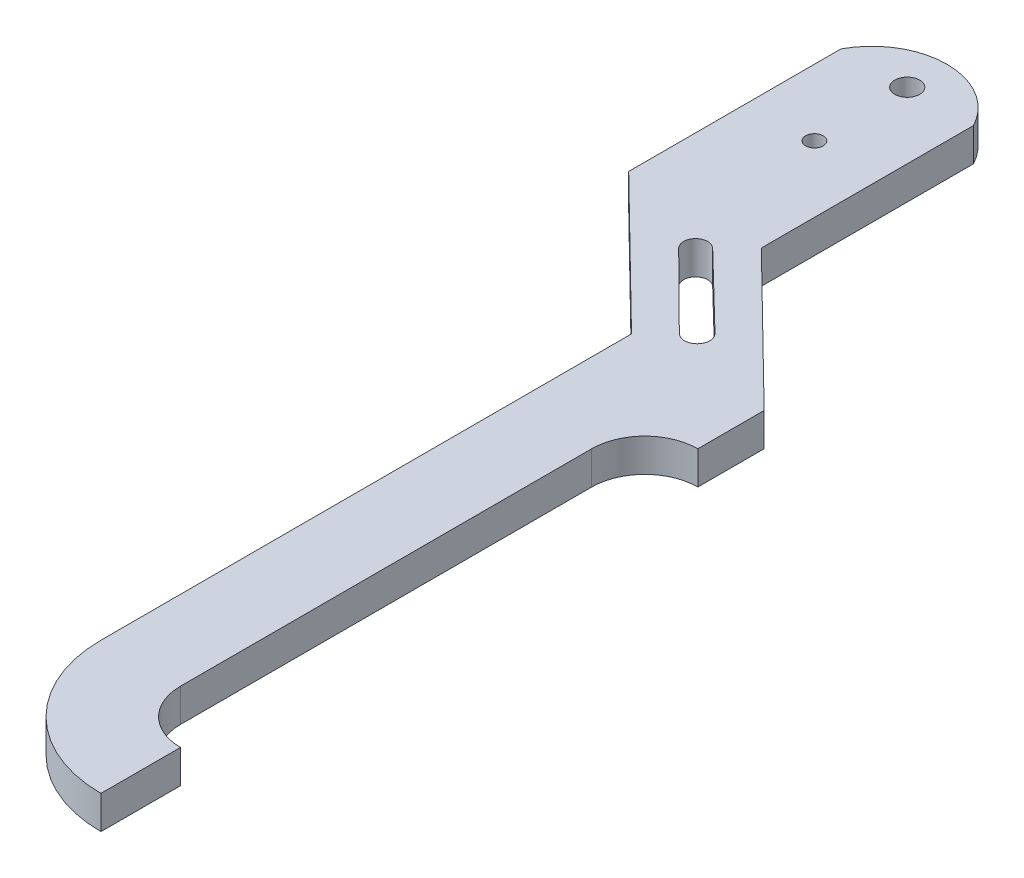
ISO-10303-21;
HEADER;
FILE_DESCRIPTION(('STEP AP214'),'2;1');
FILE_NAME('part.step','',(''),(''),'','','');
FILE_SCHEMA(('AUTOMOTIVE_DESIGN { 1 0 10303 214 1 1 1 1 }'));
ENDSEC;
DATA;
#1=APPLICATION_CONTEXT('core data for automotive mechanical design processes');
#2=APPLICATION_PROTOCOL_DEFINITION('international standard','automotive_design',2000,#1);
#3=PRODUCT_CONTEXT('',#1,'mechanical');
#4=PRODUCT('Part','Part','',(#3));
#5=PRODUCT_RELATED_PRODUCT_CATEGORY('part','',(#4));
#6=PRODUCT_DEFINITION_FORMATION('','',#4);
#7=PRODUCT_DEFINITION_CONTEXT('part definition',#1,'design');
#8=PRODUCT_DEFINITION('design','',#6,#7);
#9=PRODUCT_DEFINITION_SHAPE('','',#8);
#10=(LENGTH_UNIT() NAMED_UNIT(*) SI_UNIT(.MILLI.,.METRE.));
#11=(NAMED_UNIT(*) PLANE_ANGLE_UNIT() SI_UNIT($,.RADIAN.));
#12=(NAMED_UNIT(*) SI_UNIT($,.STERADIAN.) SOLID_ANGLE_UNIT());
#13=UNCERTAINTY_MEASURE_WITH_UNIT(LENGTH_MEASURE(1.E-05),#10,'distance_accuracy_value','');
#14=(GEOMETRIC_REPRESENTATION_CONTEXT(3) GLOBAL_UNCERTAINTY_ASSIGNED_CONTEXT((#13)) GLOBAL_UNIT_ASSIGNED_CONTEXT((#10,
#11,#12)) REPRESENTATION_CONTEXT('',''));
#15=CARTESIAN_POINT('',(0.,0.,0.));
#16=DIRECTION('',(0.,0.,1.));
#17=DIRECTION('',(1.,0.,0.));
#18=AXIS2_PLACEMENT_3D('',#15,#16,#17);
#19=CARTESIAN_POINT('',(13.2774006536528,3.175,8.37420016308551));
#20=DIRECTION('',(0.,1.,0.));
#21=DIRECTION('',(0.,0.,1.));
#22=AXIS2_PLACEMENT_3D('',#19,#20,#21);
#23=PLANE('',#22);
#24=DIRECTION('',(-0.718147190101119,0.,-0.695891236724437));
#25=VECTOR('',#24,1.);
#26=CARTESIAN_POINT('',(-2.63294068961359,3.175,-14.0382908603592));
#27=LINE('',#26,#25);
#28=CARTESIAN_POINT('',(4.52958585374168,3.175,-7.09773671904836));
#29=VERTEX_POINT('',#28);
#30=CARTESIAN_POINT('',(-2.63294068961359,3.175,-14.0382908603592));
#31=VERTEX_POINT('',#30);
#32=EDGE_CURVE('E154',#29,#31,#27,.T.);
#33=ORIENTED_EDGE('',*,*,#32,.F.);
#34=CARTESIAN_POINT('',(3.68641881720039,3.175,-6.23258353892776));
#35=DIRECTION('',(0.,1.,0.));
#36=DIRECTION('',(0.,0.,1.));
#37=AXIS2_PLACEMENT_3D('',#34,#35,#36);
#38=CIRCLE('',#37,1.20806484783831);
#39=CARTESIAN_POINT('',(2.84325178065911,3.175,-5.36743035880716));
#40=VERTEX_POINT('',#39);
#41=EDGE_CURVE('E146',#40,#29,#38,.T.);
#42=ORIENTED_EDGE('',*,*,#41,.F.);
#43=DIRECTION('',(0.710114988358507,0.,0.704085721562792));
#44=VECTOR('',#43,1.);
#45=CARTESIAN_POINT('',(2.84325178065911,3.175,-5.36743035880716));
#46=LINE('',#45,#44);
#47=CARTESIAN_POINT('',(-4.24408647952415,3.175,-12.394593219312));
#48=VERTEX_POINT('',#47);
#49=EDGE_CURVE('E169',#48,#40,#46,.T.);
#50=ORIENTED_EDGE('',*,*,#49,.F.);
#51=CARTESIAN_POINT('',(-3.43851358456887,3.175,-13.2164420398356));
#52=DIRECTION('',(0.,1.,0.));
#53=DIRECTION('',(0.,0.,-1.));
#54=AXIS2_PLACEMENT_3D('',#51,#52,#53);
#55=CIRCLE('',#54,1.15081847955389);
#56=EDGE_CURVE('E167',#31,#48,#55,.T.);
#57=ORIENTED_EDGE('',*,*,#56,.F.);
#58=EDGE_LOOP('',(#33,#42,#50,#57));
#59=FACE_BOUND('',#58,.T.);
#60=CARTESIAN_POINT('',(-6.67702050272131,3.175,-27.8207998369145));
#61=DIRECTION('',(0.,1.,0.));
#62=DIRECTION('',(0.,0.,-1.));
#63=AXIS2_PLACEMENT_3D('',#60,#61,#62);
#64=CIRCLE('',#63,0.840105000000002);
#65=CARTESIAN_POINT('',(-6.67702050272131,3.175,-28.6609048369145));
#66=VERTEX_POINT('',#65);
#67=EDGE_CURVE('E185',#66,#66,#64,.T.);
#68=ORIENTED_EDGE('',*,*,#67,.F.);
#69=EDGE_LOOP('',(#68));
#70=FACE_BOUND('',#69,.T.);
#71=CARTESIAN_POINT('',(13.2774006536528,3.175,8.37420016308551));
#72=DIRECTION('',(0.,-1.,0.));
#73=DIRECTION('',(0.,0.,1.));
#74=AXIS2_PLACEMENT_3D('',#71,#72,#73);
#75=CIRCLE('',#74,5.08);
#76=CARTESIAN_POINT('',(8.19740065365281,3.175,8.37420016308551));
#77=VERTEX_POINT('',#76);
#78=CARTESIAN_POINT('',(13.2774006536528,3.175,3.29420016308551));
#79=VERTEX_POINT('',#78);
#80=EDGE_CURVE('E191',#77,#79,#75,.T.);
#81=ORIENTED_EDGE('',*,*,#80,.T.);
#82=DIRECTION('',(0.,0.,-1.));
#83=VECTOR('',#82,1.);
#84=CARTESIAN_POINT('',(13.2774006536528,3.175,-3.05579983691449));
#85=LINE('',#84,#83);
#86=CARTESIAN_POINT('',(13.2774006536528,3.175,-3.05579983691449));
#87=VERTEX_POINT('',#86);
#88=EDGE_CURVE('E194',#79,#87,#85,.T.);
#89=ORIENTED_EDGE('',*,*,#88,.T.);
#90=DIRECTION('',(-0.714142842854285,0.,-0.7));
#91=VECTOR('',#90,1.);
#92=CARTESIAN_POINT('',(-0.32702050272132,3.175,-16.3907998369145));
#93=LINE('',#92,#91);
#94=CARTESIAN_POINT('',(-0.32702050272132,3.175,-16.3907998369145));
#95=VERTEX_POINT('',#94);
#96=EDGE_CURVE('E197',#87,#95,#93,.T.);
#97=ORIENTED_EDGE('',*,*,#96,.T.);
#98=DIRECTION('',(0.,0.,-1.));
#99=VECTOR('',#98,1.);
#100=CARTESIAN_POINT('',(-0.32702050272132,3.175,-36.7107998369145));
#101=LINE('',#100,#99);
#102=CARTESIAN_POINT('',(-0.32702050272132,3.175,-36.7107998369145));
#103=VERTEX_POINT('',#102);
#104=EDGE_CURVE('E199',#95,#103,#101,.T.);
#105=ORIENTED_EDGE('',*,*,#104,.T.);
#106=CARTESIAN_POINT('',(-6.67702050272131,3.175,-33.3241331702478));
#107=DIRECTION('',(0.,1.,0.));
#108=DIRECTION('',(0.,0.,-1.));
#109=AXIS2_PLACEMENT_3D('',#106,#107,#108);
#110=CIRCLE('',#109,7.19666666666665);
#111=CARTESIAN_POINT('',(-13.0270205027213,3.175,-36.7107998369145));
#112=VERTEX_POINT('',#111);
#113=EDGE_CURVE('E201',#103,#112,#110,.T.);
#114=ORIENTED_EDGE('',*,*,#113,.T.);
#115=DIRECTION('',(0.,0.,1.));
#116=VECTOR('',#115,1.);
#117=CARTESIAN_POINT('',(-13.0270205027213,3.175,-16.3907998369145));
#118=LINE('',#117,#116);
#119=CARTESIAN_POINT('',(-13.0270205027213,3.175,-16.3907998369145));
#120=VERTEX_POINT('',#119);
#121=EDGE_CURVE('E203',#112,#120,#118,.T.);
#122=ORIENTED_EDGE('',*,*,#121,.T.);
#123=DIRECTION('',(0.714142842854285,0.,0.699999999999999));
#124=VECTOR('',#123,1.);
#125=CARTESIAN_POINT('',(-13.0270205027213,3.175,-16.3907998369145));
#126=LINE('',#125,#124);
#127=CARTESIAN_POINT('',(0.577400653652804,3.175,-3.05579983691449));
#128=VERTEX_POINT('',#127);
#129=EDGE_CURVE('E205',#120,#128,#126,.T.);
#130=ORIENTED_EDGE('',*,*,#129,.T.);
#131=DIRECTION('',(0.,0.,1.));
#132=VECTOR('',#131,1.);
#133=CARTESIAN_POINT('',(0.577400653652804,3.175,-3.05579983691449));
#134=LINE('',#133,#132);
#135=CARTESIAN_POINT('',(0.577400653652821,3.175,47.7442001630855));
#136=VERTEX_POINT('',#135);
#137=EDGE_CURVE('E207',#128,#136,#134,.T.);
#138=ORIENTED_EDGE('',*,*,#137,.T.);
#139=CARTESIAN_POINT('',(13.2774006536528,3.175,47.7442001630855));
#140=DIRECTION('',(0.,1.,0.));
#141=DIRECTION('',(0.,0.,1.));
#142=AXIS2_PLACEMENT_3D('',#139,#140,#141);
#143=CIRCLE('',#142,12.7);
#144=CARTESIAN_POINT('',(13.2774006536528,3.175,60.4442001630855));
#145=VERTEX_POINT('',#144);
#146=EDGE_CURVE('E209',#136,#145,#143,.T.);
#147=ORIENTED_EDGE('',*,*,#146,.T.);
#148=DIRECTION('',(0.,0.,-1.));
#149=VECTOR('',#148,1.);
#150=CARTESIAN_POINT('',(13.2774006536528,3.175,52.8242001630855));
#151=LINE('',#150,#149);
#152=CARTESIAN_POINT('',(13.2774006536528,3.175,52.8242001630855));
#153=VERTEX_POINT('',#152);
#154=EDGE_CURVE('E211',#145,#153,#151,.T.);
#155=ORIENTED_EDGE('',*,*,#154,.T.);
#156=CARTESIAN_POINT('',(13.2774006536528,3.175,47.7442001630855));
#157=DIRECTION('',(0.,-1.,0.));
#158=DIRECTION('',(0.,0.,1.));
#159=AXIS2_PLACEMENT_3D('',#156,#157,#158);
#160=CIRCLE('',#159,5.08000000000002);
#161=CARTESIAN_POINT('',(8.19740065365281,3.175,47.7442001630855));
#162=VERTEX_POINT('',#161);
#163=EDGE_CURVE('E213',#153,#162,#160,.T.);
#164=ORIENTED_EDGE('',*,*,#163,.T.);
#165=DIRECTION('',(0.,0.,-1.));
#166=VECTOR('',#165,1.);
#167=CARTESIAN_POINT('',(8.19740065365281,3.175,8.37420016308551));
#168=LINE('',#167,#166);
#169=EDGE_CURVE('E215',#162,#77,#168,.T.);
#170=ORIENTED_EDGE('',*,*,#169,.T.);
#171=EDGE_LOOP('',(#81,#89,#97,#105,#114,#122,#130,#138,#147,#155,#164,#170));
#172=FACE_BOUND('',#171,.T.);
#173=CARTESIAN_POINT('',(-6.67702050272131,3.175,-36.7107998369145));
#174=DIRECTION('',(0.,1.,0.));
#175=DIRECTION('',(0.,0.,-1.));
#176=AXIS2_PLACEMENT_3D('',#173,#174,#175);
#177=CIRCLE('',#176,1.190625);
#178=CARTESIAN_POINT('',(-6.67702050272131,3.175,-37.9014248369145));
#179=VERTEX_POINT('',#178);
#180=EDGE_CURVE('E175',#179,#179,#177,.T.);
#181=ORIENTED_EDGE('',*,*,#180,.F.);
#182=EDGE_LOOP('',(#181));
#183=FACE_BOUND('',#182,.T.);
#184=ADVANCED_FACE('F33',(#59,#70,#172,#183),#23,.T.);
#185=CARTESIAN_POINT('',(13.2774006536528,0.,8.37420016308551));
#186=DIRECTION('',(0.,1.,0.));
#187=DIRECTION('',(0.,0.,1.));
#188=AXIS2_PLACEMENT_3D('',#185,#186,#187);
#189=PLANE('',#188);
#190=CARTESIAN_POINT('',(-6.67702050272131,0.,-27.8207998369145));
#191=DIRECTION('',(0.,1.,0.));
#192=DIRECTION('',(0.,0.,-1.));
#193=AXIS2_PLACEMENT_3D('',#190,#191,#192);
#194=CIRCLE('',#193,0.840105000000002);
#195=CARTESIAN_POINT('',(-6.67702050272131,0.,-28.6609048369145));
#196=VERTEX_POINT('',#195);
#197=EDGE_CURVE('E162',#196,#196,#194,.T.);
#198=ORIENTED_EDGE('',*,*,#197,.T.);
#199=EDGE_LOOP('',(#198));
#200=FACE_BOUND('',#199,.T.);
#201=CARTESIAN_POINT('',(13.2774006536528,0.,8.37420016308551));
#202=DIRECTION('',(0.,-1.,0.));
#203=DIRECTION('',(0.,0.,1.));
#204=AXIS2_PLACEMENT_3D('',#201,#202,#203);
#205=CIRCLE('',#204,5.08);
#206=CARTESIAN_POINT('',(8.19740065365281,0.,8.37420016308551));
#207=VERTEX_POINT('',#206);
#208=CARTESIAN_POINT('',(13.2774006536528,0.,3.29420016308551));
#209=VERTEX_POINT('',#208);
#210=EDGE_CURVE('E188',#207,#209,#205,.T.);
#211=ORIENTED_EDGE('',*,*,#210,.F.);
#212=DIRECTION('',(0.,0.,-1.));
#213=VECTOR('',#212,1.);
#214=CARTESIAN_POINT('',(8.19740065365281,0.,8.37420016308551));
#215=LINE('',#214,#213);
#216=CARTESIAN_POINT('',(8.19740065365281,0.,47.7442001630855));
#217=VERTEX_POINT('',#216);
#218=EDGE_CURVE('E195',#217,#207,#215,.T.);
#219=ORIENTED_EDGE('',*,*,#218,.F.);
#220=CARTESIAN_POINT('',(13.2774006536528,0.,47.7442001630855));
#221=DIRECTION('',(0.,-1.,0.));
#222=DIRECTION('',(0.,0.,1.));
#223=AXIS2_PLACEMENT_3D('',#220,#221,#222);
#224=CIRCLE('',#223,5.08000000000002);
#225=CARTESIAN_POINT('',(13.2774006536528,0.,52.8242001630855));
#226=VERTEX_POINT('',#225);
#227=EDGE_CURVE('E239',#226,#217,#224,.T.);
#228=ORIENTED_EDGE('',*,*,#227,.F.);
#229=DIRECTION('',(0.,0.,-1.));
#230=VECTOR('',#229,1.);
#231=CARTESIAN_POINT('',(13.2774006536528,0.,52.8242001630855));
#232=LINE('',#231,#230);
#233=CARTESIAN_POINT('',(13.2774006536528,0.,60.4442001630855));
#234=VERTEX_POINT('',#233);
#235=EDGE_CURVE('E237',#234,#226,#232,.T.);
#236=ORIENTED_EDGE('',*,*,#235,.F.);
#237=CARTESIAN_POINT('',(13.2774006536528,0.,47.7442001630855));
#238=DIRECTION('',(0.,1.,0.));
#239=DIRECTION('',(0.,0.,1.));
#240=AXIS2_PLACEMENT_3D('',#237,#238,#239);
#241=CIRCLE('',#240,12.7);
#242=CARTESIAN_POINT('',(0.577400653652821,0.,47.7442001630855));
#243=VERTEX_POINT('',#242);
#244=EDGE_CURVE('E235',#243,#234,#241,.T.);
#245=ORIENTED_EDGE('',*,*,#244,.F.);
#246=DIRECTION('',(0.,0.,1.));
#247=VECTOR('',#246,1.);
#248=CARTESIAN_POINT('',(0.577400653652804,0.,-3.05579983691449));
#249=LINE('',#248,#247);
#250=CARTESIAN_POINT('',(0.577400653652804,0.,-3.05579983691449));
#251=VERTEX_POINT('',#250);
#252=EDGE_CURVE('E233',#251,#243,#249,.T.);
#253=ORIENTED_EDGE('',*,*,#252,.F.);
#254=DIRECTION('',(0.714142842854285,0.,0.699999999999999));
#255=VECTOR('',#254,1.);
#256=CARTESIAN_POINT('',(-13.0270205027213,0.,-16.3907998369145));
#257=LINE('',#256,#255);
#258=CARTESIAN_POINT('',(-13.0270205027213,0.,-16.3907998369145));
#259=VERTEX_POINT('',#258);
#260=EDGE_CURVE('E231',#259,#251,#257,.T.);
#261=ORIENTED_EDGE('',*,*,#260,.F.);
#262=DIRECTION('',(0.,0.,1.));
#263=VECTOR('',#262,1.);
#264=CARTESIAN_POINT('',(-13.0270205027213,0.,-16.3907998369145));
#265=LINE('',#264,#263);
#266=CARTESIAN_POINT('',(-13.0270205027213,0.,-36.7107998369145));
#267=VERTEX_POINT('',#266);
#268=EDGE_CURVE('E229',#267,#259,#265,.T.);
#269=ORIENTED_EDGE('',*,*,#268,.F.);
#270=CARTESIAN_POINT('',(-6.67702050272131,0.,-33.3241331702478));
#271=DIRECTION('',(0.,1.,0.));
#272=DIRECTION('',(0.,0.,1.));
#273=AXIS2_PLACEMENT_3D('',#270,#271,#272);
#274=CIRCLE('',#273,7.19666666666671);
#275=CARTESIAN_POINT('',(-0.32702050272132,0.,-36.7107998369145));
#276=VERTEX_POINT('',#275);
#277=EDGE_CURVE('E227',#276,#267,#274,.T.);
#278=ORIENTED_EDGE('',*,*,#277,.F.);
#279=DIRECTION('',(0.,0.,-1.));
#280=VECTOR('',#279,1.);
#281=CARTESIAN_POINT('',(-0.32702050272132,0.,-36.7107998369145));
#282=LINE('',#281,#280);
#283=CARTESIAN_POINT('',(-0.32702050272132,0.,-16.3907998369145));
#284=VERTEX_POINT('',#283);
#285=EDGE_CURVE('E224',#284,#276,#282,.T.);
#286=ORIENTED_EDGE('',*,*,#285,.F.);
#287=DIRECTION('',(-0.714142842854285,0.,-0.7));
#288=VECTOR('',#287,1.);
#289=CARTESIAN_POINT('',(-0.32702050272132,0.,-16.3907998369145));
#290=LINE('',#289,#288);
#291=CARTESIAN_POINT('',(13.2774006536528,0.,-3.05579983691449));
#292=VERTEX_POINT('',#291);
#293=EDGE_CURVE('E222',#292,#284,#290,.T.);
#294=ORIENTED_EDGE('',*,*,#293,.F.);
#295=DIRECTION('',(0.,0.,-1.));
#296=VECTOR('',#295,1.);
#297=CARTESIAN_POINT('',(13.2774006536528,0.,-3.05579983691449));
#298=LINE('',#297,#296);
#299=EDGE_CURVE('E220',#209,#292,#298,.T.);
#300=ORIENTED_EDGE('',*,*,#299,.F.);
#301=EDGE_LOOP('',(#211,#219,#228,#236,#245,#253,#261,#269,#278,#286,#294,#300));
#302=FACE_BOUND('',#301,.T.);
#303=CARTESIAN_POINT('',(3.68641881720039,0.,-6.23258353892776));
#304=DIRECTION('',(0.,1.,0.));
#305=DIRECTION('',(0.,0.,1.));
#306=AXIS2_PLACEMENT_3D('',#303,#304,#305);
#307=CIRCLE('',#306,1.20806484783831);
#308=CARTESIAN_POINT('',(2.84325178065911,0.,-5.36743035880716));
#309=VERTEX_POINT('',#308);
#310=CARTESIAN_POINT('',(4.52958585374168,0.,-7.09773671904836));
#311=VERTEX_POINT('',#310);
#312=EDGE_CURVE('E56',#309,#311,#307,.T.);
#313=ORIENTED_EDGE('',*,*,#312,.T.);
#314=DIRECTION('',(-0.718147190101119,0.,-0.695891236724437));
#315=VECTOR('',#314,1.);
#316=CARTESIAN_POINT('',(-2.63294068961359,0.,-14.0382908603592));
#317=LINE('',#316,#315);
#318=CARTESIAN_POINT('',(-2.63294068961359,0.,-14.0382908603592));
#319=VERTEX_POINT('',#318);
#320=EDGE_CURVE('E161',#311,#319,#317,.T.);
#321=ORIENTED_EDGE('',*,*,#320,.T.);
#322=CARTESIAN_POINT('',(-3.43851358456887,0.,-13.2164420398356));
#323=DIRECTION('',(0.,1.,0.));
#324=DIRECTION('',(0.,0.,-1.));
#325=AXIS2_PLACEMENT_3D('',#322,#323,#324);
#326=CIRCLE('',#325,1.15081847955389);
#327=CARTESIAN_POINT('',(-4.24408647952415,0.,-12.394593219312));
#328=VERTEX_POINT('',#327);
#329=EDGE_CURVE('E177',#319,#328,#326,.T.);
#330=ORIENTED_EDGE('',*,*,#329,.T.);
#331=DIRECTION('',(0.710114988358507,0.,0.704085721562792));
#332=VECTOR('',#331,1.);
#333=CARTESIAN_POINT('',(2.84325178065911,0.,-5.36743035880716));
#334=LINE('',#333,#332);
#335=EDGE_CURVE('E155',#328,#309,#334,.T.);
#336=ORIENTED_EDGE('',*,*,#335,.T.);
#337=EDGE_LOOP('',(#313,#321,#330,#336));
#338=FACE_BOUND('',#337,.T.);
#339=CARTESIAN_POINT('',(-6.67702050272131,0.,-36.7107998369145));
#340=DIRECTION('',(0.,1.,0.));
#341=DIRECTION('',(0.,0.,-1.));
#342=AXIS2_PLACEMENT_3D('',#339,#340,#341);
#343=CIRCLE('',#342,1.190625);
#344=CARTESIAN_POINT('',(-6.67702050272131,0.,-37.9014248369145));
#345=VERTEX_POINT('',#344);
#346=EDGE_CURVE('E506',#345,#345,#343,.T.);
#347=ORIENTED_EDGE('',*,*,#346,.T.);
#348=EDGE_LOOP('',(#347));
#349=FACE_BOUND('',#348,.T.);
#350=ADVANCED_FACE('F281',(#200,#302,#338,#349),#189,.F.);
#351=CARTESIAN_POINT('',(13.2774006536528,3.175,8.37420016308551));
#352=DIRECTION('',(0.,-1.,0.));
#353=DIRECTION('',(0.,0.,-1.));
#354=AXIS2_PLACEMENT_3D('',#351,#352,#353);
#355=CYLINDRICAL_SURFACE('',#354,5.08);
#356=ORIENTED_EDGE('',*,*,#210,.T.);
#357=DIRECTION('',(0.,-1.,0.));
#358=VECTOR('',#357,1.);
#359=CARTESIAN_POINT('',(13.2774006536528,3.175,3.29420016308551));
#360=LINE('',#359,#358);
#361=EDGE_CURVE('E11',#79,#209,#360,.T.);
#362=ORIENTED_EDGE('',*,*,#361,.F.);
#363=ORIENTED_EDGE('',*,*,#80,.F.);
#364=DIRECTION('',(0.,-1.,0.));
#365=VECTOR('',#364,1.);
#366=CARTESIAN_POINT('',(8.19740065365281,3.175,8.37420016308551));
#367=LINE('',#366,#365);
#368=EDGE_CURVE('E217',#77,#207,#367,.T.);
#369=ORIENTED_EDGE('',*,*,#368,.T.);
#370=EDGE_LOOP('',(#356,#362,#363,#369));
#371=FACE_BOUND('',#370,.T.);
#372=ADVANCED_FACE('F35',(#371),#355,.F.);
#373=CARTESIAN_POINT('',(13.2774006536528,3.175,-3.05579983691449));
#374=DIRECTION('',(-1.,0.,0.));
#375=DIRECTION('',(0.,0.,1.));
#376=AXIS2_PLACEMENT_3D('',#373,#374,#375);
#377=PLANE('',#376);
#378=ORIENTED_EDGE('',*,*,#299,.T.);
#379=DIRECTION('',(0.,-1.,0.));
#380=VECTOR('',#379,1.);
#381=CARTESIAN_POINT('',(13.2774006536528,3.175,-3.05579983691449));
#382=LINE('',#381,#380);
#383=EDGE_CURVE('E41',#87,#292,#382,.T.);
#384=ORIENTED_EDGE('',*,*,#383,.F.);
#385=ORIENTED_EDGE('',*,*,#88,.F.);
#386=ORIENTED_EDGE('',*,*,#361,.T.);
#387=EDGE_LOOP('',(#378,#384,#385,#386));
#388=FACE_BOUND('',#387,.T.);
#389=ADVANCED_FACE('F298',(#388),#377,.F.);
#390=CARTESIAN_POINT('',(-0.32702050272132,3.175,-16.3907998369145));
#391=DIRECTION('',(-0.7,0.,0.714142842854285));
#392=DIRECTION('',(0.714142842854285,0.,0.7));
#393=AXIS2_PLACEMENT_3D('',#390,#391,#392);
#394=PLANE('',#393);
#395=ORIENTED_EDGE('',*,*,#293,.T.);
#396=DIRECTION('',(0.,-1.,0.));
#397=VECTOR('',#396,1.);
#398=CARTESIAN_POINT('',(-0.32702050272132,3.175,-16.3907998369145));
#399=LINE('',#398,#397);
#400=EDGE_CURVE('E268',#95,#284,#399,.T.);
#401=ORIENTED_EDGE('',*,*,#400,.F.);
#402=ORIENTED_EDGE('',*,*,#96,.F.);
#403=ORIENTED_EDGE('',*,*,#383,.T.);
#404=EDGE_LOOP('',(#395,#401,#402,#403));
#405=FACE_BOUND('',#404,.T.);
#406=ADVANCED_FACE('F275',(#405),#394,.F.);
#407=CARTESIAN_POINT('',(-0.32702050272132,3.175,-36.7107998369145));
#408=DIRECTION('',(-1.,0.,0.));
#409=DIRECTION('',(0.,0.,1.));
#410=AXIS2_PLACEMENT_3D('',#407,#408,#409);
#411=PLANE('',#410);
#412=ORIENTED_EDGE('',*,*,#285,.T.);
#413=DIRECTION('',(0.,-1.,0.));
#414=VECTOR('',#413,1.);
#415=CARTESIAN_POINT('',(-0.32702050272132,3.175,-36.7107998369145));
#416=LINE('',#415,#414);
#417=EDGE_CURVE('E265',#103,#276,#416,.T.);
#418=ORIENTED_EDGE('',*,*,#417,.F.);
#419=ORIENTED_EDGE('',*,*,#104,.F.);
#420=ORIENTED_EDGE('',*,*,#400,.T.);
#421=EDGE_LOOP('',(#412,#418,#419,#420));
#422=FACE_BOUND('',#421,.T.);
#423=ADVANCED_FACE('F286',(#422),#411,.F.);
#424=CARTESIAN_POINT('',(-6.67702050272131,3.175,-33.3241331702478));
#425=DIRECTION('',(0.,-1.,0.));
#426=DIRECTION('',(0.,0.,-1.));
#427=AXIS2_PLACEMENT_3D('',#424,#425,#426);
#428=CYLINDRICAL_SURFACE('',#427,7.19666666666671);
#429=ORIENTED_EDGE('',*,*,#277,.T.);
#430=DIRECTION('',(0.,-1.,0.));
#431=VECTOR('',#430,1.);
#432=CARTESIAN_POINT('',(-13.0270205027213,3.175,-36.7107998369145));
#433=LINE('',#432,#431);
#434=EDGE_CURVE('E262',#112,#267,#433,.T.);
#435=ORIENTED_EDGE('',*,*,#434,.F.);
#436=ORIENTED_EDGE('',*,*,#113,.F.);
#437=ORIENTED_EDGE('',*,*,#417,.T.);
#438=EDGE_LOOP('',(#429,#435,#436,#437));
#439=FACE_BOUND('',#438,.T.);
#440=ADVANCED_FACE('F290',(#439),#428,.T.);
#441=CARTESIAN_POINT('',(-13.0270205027213,3.175,-16.3907998369145));
#442=DIRECTION('',(1.,0.,0.));
#443=DIRECTION('',(0.,0.,-1.));
#444=AXIS2_PLACEMENT_3D('',#441,#442,#443);
#445=PLANE('',#444);
#446=ORIENTED_EDGE('',*,*,#268,.T.);
#447=DIRECTION('',(0.,-1.,0.));
#448=VECTOR('',#447,1.);
#449=CARTESIAN_POINT('',(-13.0270205027213,3.175,-16.3907998369145));
#450=LINE('',#449,#448);
#451=EDGE_CURVE('E259',#120,#259,#450,.T.);
#452=ORIENTED_EDGE('',*,*,#451,.F.);
#453=ORIENTED_EDGE('',*,*,#121,.F.);
#454=ORIENTED_EDGE('',*,*,#434,.T.);
#455=EDGE_LOOP('',(#446,#452,#453,#454));
#456=FACE_BOUND('',#455,.T.);
#457=ADVANCED_FACE('F331',(#456),#445,.F.);
#458=CARTESIAN_POINT('',(-13.0270205027213,3.175,-16.3907998369145));
#459=DIRECTION('',(0.699999999999999,0.,-0.714142842854285));
#460=DIRECTION('',(-0.714142842854286,0.,-0.7));
#461=AXIS2_PLACEMENT_3D('',#458,#459,#460);
#462=PLANE('',#461);
#463=ORIENTED_EDGE('',*,*,#260,.T.);
#464=DIRECTION('',(0.,-1.,0.));
#465=VECTOR('',#464,1.);
#466=CARTESIAN_POINT('',(0.577400653652804,3.175,-3.05579983691449));
#467=LINE('',#466,#465);
#468=EDGE_CURVE('E256',#128,#251,#467,.T.);
#469=ORIENTED_EDGE('',*,*,#468,.F.);
#470=ORIENTED_EDGE('',*,*,#129,.F.);
#471=ORIENTED_EDGE('',*,*,#451,.T.);
#472=EDGE_LOOP('',(#463,#469,#470,#471));
#473=FACE_BOUND('',#472,.T.);
#474=ADVANCED_FACE('F329',(#473),#462,.F.);
#475=CARTESIAN_POINT('',(0.577400653652804,3.175,-3.05579983691449));
#476=DIRECTION('',(1.,0.,0.));
#477=DIRECTION('',(0.,0.,-1.));
#478=AXIS2_PLACEMENT_3D('',#475,#476,#477);
#479=PLANE('',#478);
#480=ORIENTED_EDGE('',*,*,#252,.T.);
#481=DIRECTION('',(0.,-1.,0.));
#482=VECTOR('',#481,1.);
#483=CARTESIAN_POINT('',(0.577400653652821,3.175,47.7442001630855));
#484=LINE('',#483,#482);
#485=EDGE_CURVE('E253',#136,#243,#484,.T.);
#486=ORIENTED_EDGE('',*,*,#485,.F.);
#487=ORIENTED_EDGE('',*,*,#137,.F.);
#488=ORIENTED_EDGE('',*,*,#468,.T.);
#489=EDGE_LOOP('',(#480,#486,#487,#488));
#490=FACE_BOUND('',#489,.T.);
#491=ADVANCED_FACE('F325',(#490),#479,.F.);
#492=CARTESIAN_POINT('',(13.2774006536528,3.175,47.7442001630855));
#493=DIRECTION('',(0.,-1.,0.));
#494=DIRECTION('',(0.,0.,-1.));
#495=AXIS2_PLACEMENT_3D('',#492,#493,#494);
#496=CYLINDRICAL_SURFACE('',#495,12.7);
#497=ORIENTED_EDGE('',*,*,#244,.T.);
#498=DIRECTION('',(0.,-1.,0.));
#499=VECTOR('',#498,1.);
#500=CARTESIAN_POINT('',(13.2774006536528,3.175,60.4442001630855));
#501=LINE('',#500,#499);
#502=EDGE_CURVE('E250',#145,#234,#501,.T.);
#503=ORIENTED_EDGE('',*,*,#502,.F.);
#504=ORIENTED_EDGE('',*,*,#146,.F.);
#505=ORIENTED_EDGE('',*,*,#485,.T.);
#506=EDGE_LOOP('',(#497,#503,#504,#505));
#507=FACE_BOUND('',#506,.T.);
#508=ADVANCED_FACE('F320',(#507),#496,.T.);
#509=CARTESIAN_POINT('',(13.2774006536528,3.175,52.8242001630855));
#510=DIRECTION('',(-1.,0.,0.));
#511=DIRECTION('',(0.,0.,1.));
#512=AXIS2_PLACEMENT_3D('',#509,#510,#511);
#513=PLANE('',#512);
#514=ORIENTED_EDGE('',*,*,#235,.T.);
#515=DIRECTION('',(0.,-1.,0.));
#516=VECTOR('',#515,1.);
#517=CARTESIAN_POINT('',(13.2774006536528,3.175,52.8242001630855));
#518=LINE('',#517,#516);
#519=EDGE_CURVE('E247',#153,#226,#518,.T.);
#520=ORIENTED_EDGE('',*,*,#519,.F.);
#521=ORIENTED_EDGE('',*,*,#154,.F.);
#522=ORIENTED_EDGE('',*,*,#502,.T.);
#523=EDGE_LOOP('',(#514,#520,#521,#522));
#524=FACE_BOUND('',#523,.T.);
#525=ADVANCED_FACE('F314',(#524),#513,.F.);
#526=CARTESIAN_POINT('',(13.2774006536528,3.175,47.7442001630855));
#527=DIRECTION('',(0.,-1.,0.));
#528=DIRECTION('',(0.,0.,-1.));
#529=AXIS2_PLACEMENT_3D('',#526,#527,#528);
#530=CYLINDRICAL_SURFACE('',#529,5.08000000000002);
#531=ORIENTED_EDGE('',*,*,#227,.T.);
#532=DIRECTION('',(0.,-1.,0.));
#533=VECTOR('',#532,1.);
#534=CARTESIAN_POINT('',(8.19740065365281,3.175,47.7442001630855));
#535=LINE('',#534,#533);
#536=EDGE_CURVE('E244',#162,#217,#535,.T.);
#537=ORIENTED_EDGE('',*,*,#536,.F.);
#538=ORIENTED_EDGE('',*,*,#163,.F.);
#539=ORIENTED_EDGE('',*,*,#519,.T.);
#540=EDGE_LOOP('',(#531,#537,#538,#539));
#541=FACE_BOUND('',#540,.T.);
#542=ADVANCED_FACE('F310',(#541),#530,.F.);
#543=CARTESIAN_POINT('',(8.19740065365281,3.175,8.37420016308551));
#544=DIRECTION('',(-1.,0.,0.));
#545=DIRECTION('',(0.,0.,1.));
#546=AXIS2_PLACEMENT_3D('',#543,#544,#545);
#547=PLANE('',#546);
#548=ORIENTED_EDGE('',*,*,#218,.T.);
#549=ORIENTED_EDGE('',*,*,#368,.F.);
#550=ORIENTED_EDGE('',*,*,#169,.F.);
#551=ORIENTED_EDGE('',*,*,#536,.T.);
#552=EDGE_LOOP('',(#548,#549,#550,#551));
#553=FACE_BOUND('',#552,.T.);
#554=ADVANCED_FACE('F305',(#553),#547,.F.);
#555=CARTESIAN_POINT('',(-6.67702050272131,3.175,-27.8207998369145));
#556=DIRECTION('',(0.,-1.,0.));
#557=DIRECTION('',(0.,0.,-1.));
#558=AXIS2_PLACEMENT_3D('',#555,#556,#557);
#559=CYLINDRICAL_SURFACE('',#558,0.840105000000002);
#560=ORIENTED_EDGE('',*,*,#67,.T.);
#561=EDGE_LOOP('',(#560));
#562=FACE_BOUND('',#561,.T.);
#563=ORIENTED_EDGE('',*,*,#197,.F.);
#564=EDGE_LOOP('',(#563));
#565=FACE_BOUND('',#564,.T.);
#566=ADVANCED_FACE('F348',(#562,#565),#559,.F.);
#567=CARTESIAN_POINT('',(3.68641881720039,3.175,-6.23258353892776));
#568=DIRECTION('',(0.,-1.,0.));
#569=DIRECTION('',(0.,0.,-1.));
#570=AXIS2_PLACEMENT_3D('',#567,#568,#569);
#571=CYLINDRICAL_SURFACE('',#570,1.20806484783831);
#572=ORIENTED_EDGE('',*,*,#312,.F.);
#573=DIRECTION('',(0.,-1.,0.));
#574=VECTOR('',#573,1.);
#575=CARTESIAN_POINT('',(2.84325178065911,3.175,-5.36743035880716));
#576=LINE('',#575,#574);
#577=EDGE_CURVE('E150',#40,#309,#576,.T.);
#578=ORIENTED_EDGE('',*,*,#577,.F.);
#579=ORIENTED_EDGE('',*,*,#41,.T.);
#580=DIRECTION('',(0.,-1.,0.));
#581=VECTOR('',#580,1.);
#582=CARTESIAN_POINT('',(4.52958585374168,3.175,-7.09773671904836));
#583=LINE('',#582,#581);
#584=EDGE_CURVE('E149',#29,#311,#583,.T.);
#585=ORIENTED_EDGE('',*,*,#584,.T.);
#586=EDGE_LOOP('',(#572,#578,#579,#585));
#587=FACE_BOUND('',#586,.T.);
#588=ADVANCED_FACE('F148',(#587),#571,.F.);
#589=CARTESIAN_POINT('',(-2.63294068961359,3.175,-14.0382908603592));
#590=DIRECTION('',(-0.695891236724437,0.,0.718147190101119));
#591=DIRECTION('',(0.718147190101119,0.,0.695891236724437));
#592=AXIS2_PLACEMENT_3D('',#589,#590,#591);
#593=PLANE('',#592);
#594=ORIENTED_EDGE('',*,*,#320,.F.);
#595=ORIENTED_EDGE('',*,*,#584,.F.);
#596=ORIENTED_EDGE('',*,*,#32,.T.);
#597=DIRECTION('',(0.,-1.,0.));
#598=VECTOR('',#597,1.);
#599=CARTESIAN_POINT('',(-2.63294068961359,3.175,-14.0382908603592));
#600=LINE('',#599,#598);
#601=EDGE_CURVE('E163',#31,#319,#600,.T.);
#602=ORIENTED_EDGE('',*,*,#601,.T.);
#603=EDGE_LOOP('',(#594,#595,#596,#602));
#604=FACE_BOUND('',#603,.T.);
#605=ADVANCED_FACE('F158',(#604),#593,.T.);
#606=CARTESIAN_POINT('',(-3.43851358456887,3.175,-13.2164420398356));
#607=DIRECTION('',(0.,-1.,0.));
#608=DIRECTION('',(0.,0.,-1.));
#609=AXIS2_PLACEMENT_3D('',#606,#607,#608);
#610=CYLINDRICAL_SURFACE('',#609,1.15081847955389);
#611=ORIENTED_EDGE('',*,*,#329,.F.);
#612=ORIENTED_EDGE('',*,*,#601,.F.);
#613=ORIENTED_EDGE('',*,*,#56,.T.);
#614=DIRECTION('',(0.,-1.,0.));
#615=VECTOR('',#614,1.);
#616=CARTESIAN_POINT('',(-4.24408647952415,3.175,-12.394593219312));
#617=LINE('',#616,#615);
#618=EDGE_CURVE('E48',#48,#328,#617,.T.);
#619=ORIENTED_EDGE('',*,*,#618,.T.);
#620=EDGE_LOOP('',(#611,#612,#613,#619));
#621=FACE_BOUND('',#620,.T.);
#622=ADVANCED_FACE('F397',(#621),#610,.F.);
#623=CARTESIAN_POINT('',(2.84325178065911,3.175,-5.36743035880716));
#624=DIRECTION('',(0.704085721562792,0.,-0.710114988358507));
#625=DIRECTION('',(-0.710114988358507,0.,-0.704085721562792));
#626=AXIS2_PLACEMENT_3D('',#623,#624,#625);
#627=PLANE('',#626);
#628=ORIENTED_EDGE('',*,*,#335,.F.);
#629=ORIENTED_EDGE('',*,*,#618,.F.);
#630=ORIENTED_EDGE('',*,*,#49,.T.);
#631=ORIENTED_EDGE('',*,*,#577,.T.);
#632=EDGE_LOOP('',(#628,#629,#630,#631));
#633=FACE_BOUND('',#632,.T.);
#634=ADVANCED_FACE('F404',(#633),#627,.T.);
#635=CARTESIAN_POINT('',(-6.67702050272131,3.175,-36.7107998369145));
#636=DIRECTION('',(0.,-1.,0.));
#637=DIRECTION('',(0.,0.,-1.));
#638=AXIS2_PLACEMENT_3D('',#635,#636,#637);
#639=CYLINDRICAL_SURFACE('',#638,1.190625);
#640=ORIENTED_EDGE('',*,*,#180,.T.);
#641=EDGE_LOOP('',(#640));
#642=FACE_BOUND('',#641,.T.);
#643=ORIENTED_EDGE('',*,*,#346,.F.);
#644=EDGE_LOOP('',(#643));
#645=FACE_BOUND('',#644,.T.);
#646=ADVANCED_FACE('F412',(#642,#645),#639,.F.);
#647=CLOSED_SHELL('',(#184,#350,#372,#389,#406,#423,#440,#457,#474,#491,#508,#525,#542,#554,
#566,#588,#605,#622,#634,#646));
#648=MANIFOLD_SOLID_BREP('B2',#647);
#649=ADVANCED_BREP_SHAPE_REPRESENTATION('',(#18,#648),#14);
#650=SHAPE_DEFINITION_REPRESENTATION(#9,#649);
ENDSEC;
END-ISO-10303-21;
